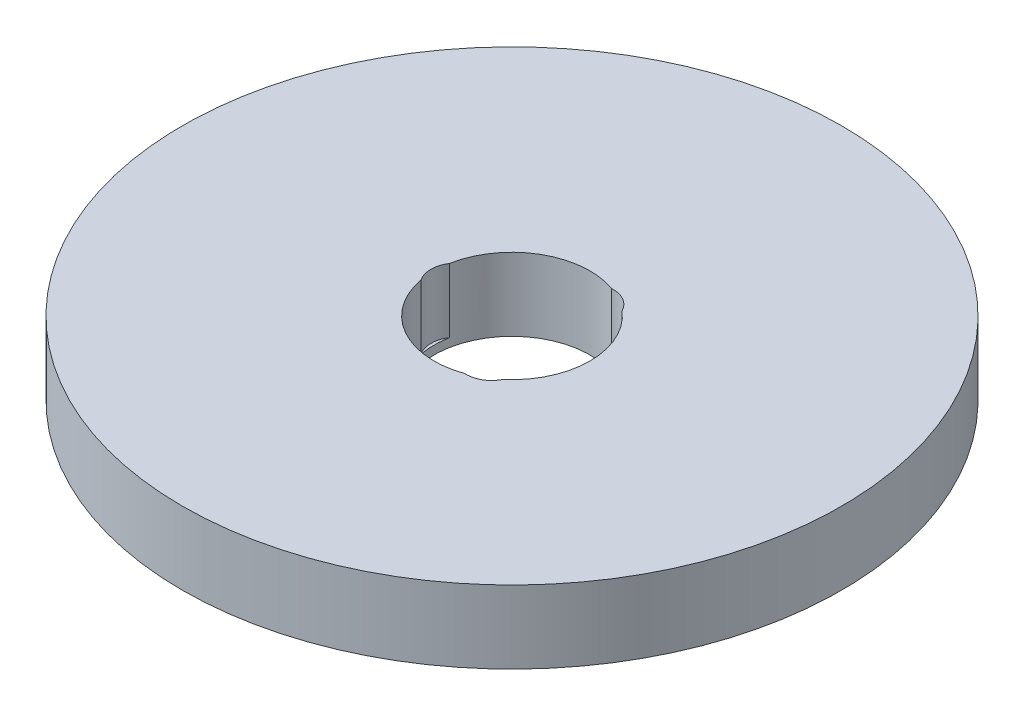
ISO-10303-21;
HEADER;
FILE_DESCRIPTION(('STEP AP214'),'2;1');
FILE_NAME('part.step','',(''),(''),'','','');
FILE_SCHEMA(('AUTOMOTIVE_DESIGN { 1 0 10303 214 1 1 1 1 }'));
ENDSEC;
DATA;
#1=APPLICATION_CONTEXT('core data for automotive mechanical design processes');
#2=APPLICATION_PROTOCOL_DEFINITION('international standard','automotive_design',2000,#1);
#3=PRODUCT_CONTEXT('',#1,'mechanical');
#4=PRODUCT('Part','Part','',(#3));
#5=PRODUCT_RELATED_PRODUCT_CATEGORY('part','',(#4));
#6=PRODUCT_DEFINITION_FORMATION('','',#4);
#7=PRODUCT_DEFINITION_CONTEXT('part definition',#1,'design');
#8=PRODUCT_DEFINITION('design','',#6,#7);
#9=PRODUCT_DEFINITION_SHAPE('','',#8);
#10=(LENGTH_UNIT() NAMED_UNIT(*) SI_UNIT(.MILLI.,.METRE.));
#11=(NAMED_UNIT(*) PLANE_ANGLE_UNIT() SI_UNIT($,.RADIAN.));
#12=(NAMED_UNIT(*) SI_UNIT($,.STERADIAN.) SOLID_ANGLE_UNIT());
#13=UNCERTAINTY_MEASURE_WITH_UNIT(LENGTH_MEASURE(1.E-05),#10,'distance_accuracy_value','');
#14=(GEOMETRIC_REPRESENTATION_CONTEXT(3) GLOBAL_UNCERTAINTY_ASSIGNED_CONTEXT((#13)) GLOBAL_UNIT_ASSIGNED_CONTEXT((#10,
#11,#12)) REPRESENTATION_CONTEXT('',''));
#15=CARTESIAN_POINT('',(0.,0.,0.));
#16=DIRECTION('',(0.,0.,1.));
#17=DIRECTION('',(1.,0.,0.));
#18=AXIS2_PLACEMENT_3D('',#15,#16,#17);
#19=CARTESIAN_POINT('',(0.,21.,0.));
#20=DIRECTION('',(0.,-1.,0.));
#21=DIRECTION('',(0.,0.,-1.));
#22=AXIS2_PLACEMENT_3D('',#19,#20,#21);
#23=CYLINDRICAL_SURFACE('',#22,95.);
#24=CARTESIAN_POINT('',(0.,21.,0.));
#25=DIRECTION('',(0.,1.,0.));
#26=DIRECTION('',(0.,0.,1.));
#27=AXIS2_PLACEMENT_3D('',#24,#25,#26);
#28=CIRCLE('',#27,95.);
#29=CARTESIAN_POINT('',(0.,21.,-95.));
#30=VERTEX_POINT('',#29);
#31=EDGE_CURVE('E130',#30,#30,#28,.T.);
#32=CARTESIAN_POINT('',(0.,0.,0.));
#33=DIRECTION('',(0.,1.,0.));
#34=DIRECTION('',(0.,0.,1.));
#35=AXIS2_PLACEMENT_3D('',#32,#33,#34);
#36=CIRCLE('',#35,95.);
#37=CARTESIAN_POINT('',(0.,0.,-95.));
#38=VERTEX_POINT('',#37);
#39=EDGE_CURVE('E117',#38,#38,#36,.T.);
#40=CARTESIAN_POINT('',(0.,21.,-95.));
#41=CARTESIAN_POINT('',(0.,20.78125,-95.));
#42=CARTESIAN_POINT('',(0.,20.5625,-95.));
#43=CARTESIAN_POINT('',(0.,20.125,-95.));
#44=CARTESIAN_POINT('',(0.,19.90625,-95.));
#45=CARTESIAN_POINT('',(0.,19.46875,-95.));
#46=CARTESIAN_POINT('',(0.,19.25,-95.));
#47=CARTESIAN_POINT('',(0.,18.8125,-95.));
#48=CARTESIAN_POINT('',(0.,18.59375,-95.));
#49=CARTESIAN_POINT('',(0.,18.15625,-95.));
#50=CARTESIAN_POINT('',(0.,17.9375,-95.));
#51=CARTESIAN_POINT('',(0.,17.5,-95.));
#52=CARTESIAN_POINT('',(0.,17.28125,-95.));
#53=CARTESIAN_POINT('',(0.,16.84375,-95.));
#54=CARTESIAN_POINT('',(0.,16.625,-95.));
#55=CARTESIAN_POINT('',(0.,16.1875,-95.));
#56=CARTESIAN_POINT('',(0.,15.96875,-95.));
#57=CARTESIAN_POINT('',(0.,15.53125,-95.));
#58=CARTESIAN_POINT('',(0.,15.3125,-95.));
#59=CARTESIAN_POINT('',(0.,14.875,-95.));
#60=CARTESIAN_POINT('',(0.,14.65625,-95.));
#61=CARTESIAN_POINT('',(0.,14.21875,-95.));
#62=CARTESIAN_POINT('',(0.,14.,-95.));
#63=CARTESIAN_POINT('',(0.,13.5625,-95.));
#64=CARTESIAN_POINT('',(0.,13.34375,-95.));
#65=CARTESIAN_POINT('',(0.,12.90625,-95.));
#66=CARTESIAN_POINT('',(0.,12.6875,-95.));
#67=CARTESIAN_POINT('',(0.,12.25,-95.));
#68=CARTESIAN_POINT('',(0.,12.03125,-95.));
#69=CARTESIAN_POINT('',(0.,11.59375,-95.));
#70=CARTESIAN_POINT('',(0.,11.375,-95.));
#71=CARTESIAN_POINT('',(0.,10.9375,-95.));
#72=CARTESIAN_POINT('',(0.,10.71875,-95.));
#73=CARTESIAN_POINT('',(0.,10.28125,-95.));
#74=CARTESIAN_POINT('',(0.,10.0625,-95.));
#75=CARTESIAN_POINT('',(0.,9.625,-95.));
#76=CARTESIAN_POINT('',(0.,9.40625,-95.));
#77=CARTESIAN_POINT('',(0.,8.96875,-95.));
#78=CARTESIAN_POINT('',(0.,8.75,-95.));
#79=CARTESIAN_POINT('',(0.,8.3125,-95.));
#80=CARTESIAN_POINT('',(0.,8.09375,-95.));
#81=CARTESIAN_POINT('',(0.,7.65625,-95.));
#82=CARTESIAN_POINT('',(0.,7.4375,-95.));
#83=CARTESIAN_POINT('',(0.,7.,-95.));
#84=CARTESIAN_POINT('',(0.,6.78125,-95.));
#85=CARTESIAN_POINT('',(0.,6.34375,-95.));
#86=CARTESIAN_POINT('',(0.,6.125,-95.));
#87=CARTESIAN_POINT('',(0.,5.6875,-95.));
#88=CARTESIAN_POINT('',(0.,5.46875,-95.));
#89=CARTESIAN_POINT('',(0.,5.03125,-95.));
#90=CARTESIAN_POINT('',(0.,4.8125,-95.));
#91=CARTESIAN_POINT('',(0.,4.375,-95.));
#92=CARTESIAN_POINT('',(0.,4.15625,-95.));
#93=CARTESIAN_POINT('',(0.,3.71875,-95.));
#94=CARTESIAN_POINT('',(0.,3.5,-95.));
#95=CARTESIAN_POINT('',(0.,3.0625,-95.));
#96=CARTESIAN_POINT('',(0.,2.84375,-95.));
#97=CARTESIAN_POINT('',(0.,2.40625,-95.));
#98=CARTESIAN_POINT('',(0.,2.1875,-95.));
#99=CARTESIAN_POINT('',(0.,1.75,-95.));
#100=CARTESIAN_POINT('',(0.,1.53125,-95.));
#101=CARTESIAN_POINT('',(0.,1.09375,-95.));
#102=CARTESIAN_POINT('',(0.,0.875000000000001,-95.));
#103=CARTESIAN_POINT('',(0.,0.4375,-95.));
#104=CARTESIAN_POINT('',(0.,0.21875,-95.));
#105=CARTESIAN_POINT('',(0.,0.,-95.));
#106=B_SPLINE_CURVE_WITH_KNOTS('',3,(#40,#41,#42,#43,#44,#45,#46,#47,#48,#49,#50,#51,#52,#53,
#54,#55,#56,#57,#58,#59,#60,#61,#62,#63,#64,#65,#66,#67,#68,#69,#70,#71,#72,#73,#74,#75,#76,#77,
#78,#79,#80,#81,#82,#83,#84,#85,#86,#87,#88,#89,#90,#91,#92,#93,#94,#95,#96,#97,#98,#99,#100,
#101,#102,#103,#104,#105),.UNSPECIFIED.,.F.,.F.,(4,2,2,2,2,2,2,2,2,2,2,2,2,2,2,2,2,2,2,2,2,2,2,
2,2,2,2,2,2,2,2,2,4),(0.,0.656249999999997,1.3125,1.96875,2.625,3.28125,3.9375,4.59375,5.25,
5.90625,6.5625,7.21875,7.875,8.53125,9.1875,9.84375,10.5,11.15625,11.8125,12.46875,13.125,
13.78125,14.4375,15.09375,15.75,16.40625,17.0625,17.71875,18.375,19.03125,19.6875,20.34375,21.),.UNSPECIFIED.);
#107=EDGE_CURVE('BSEAM39',#30,#38,#106,.T.);
#108=ORIENTED_EDGE('',*,*,#31,.F.);
#109=ORIENTED_EDGE('',*,*,#39,.T.);
#110=ORIENTED_EDGE('',*,*,#107,.T.);
#111=ORIENTED_EDGE('',*,*,#107,.F.);
#112=EDGE_LOOP('',(#108,#110,#109,#111));
#113=FACE_BOUND('',#112,.T.);
#114=ADVANCED_FACE('F39',(#113),#23,.T.);
#115=CARTESIAN_POINT('',(0.,21.,0.));
#116=DIRECTION('',(0.,1.,0.));
#117=DIRECTION('',(0.,0.,1.));
#118=AXIS2_PLACEMENT_3D('',#115,#116,#117);
#119=PLANE('',#118);
#120=CARTESIAN_POINT('',(7.97936512743033,21.,13.8206658128525));
#121=DIRECTION('',(0.,1.,0.));
#122=DIRECTION('',(0.866025403784436,0.,-0.500000000000004));
#123=AXIS2_PLACEMENT_3D('',#120,#121,#122);
#124=CIRCLE('',#123,7.38393204363788);
#125=CARTESIAN_POINT('',(7.55810302005219,21.,21.1925713102086));
#126=VERTEX_POINT('',#125);
#127=CARTESIAN_POINT('',(14.574253616128,21.,17.1417948748893));
#128=VERTEX_POINT('',#127);
#129=EDGE_CURVE('E148',#126,#128,#124,.T.);
#130=ORIENTED_EDGE('',*,*,#129,.F.);
#131=CARTESIAN_POINT('',(0.,21.,0.));
#132=DIRECTION('',(0.,1.,0.));
#133=DIRECTION('',(0.,0.,1.));
#134=AXIS2_PLACEMENT_3D('',#131,#132,#133);
#135=CIRCLE('',#134,22.5);
#136=CARTESIAN_POINT('',(-22.13235663618,21.,4.05077643531933));
#137=VERTEX_POINT('',#136);
#138=EDGE_CURVE('E113',#137,#126,#135,.T.);
#139=ORIENTED_EDGE('',*,*,#138,.F.);
#140=CARTESIAN_POINT('',(-15.9587302548605,21.,0.));
#141=DIRECTION('',(0.,1.,0.));
#142=DIRECTION('',(0.,0.,1.));
#143=AXIS2_PLACEMENT_3D('',#140,#141,#142);
#144=CIRCLE('',#143,7.38393204363788);
#145=CARTESIAN_POINT('',(-22.13235663618,21.,-4.05077643531933));
#146=VERTEX_POINT('',#145);
#147=EDGE_CURVE('E125',#146,#137,#144,.T.);
#148=ORIENTED_EDGE('',*,*,#147,.F.);
#149=CARTESIAN_POINT('',(7.55810302005191,21.,-21.1925713102087));
#150=VERTEX_POINT('',#149);
#151=EDGE_CURVE('E107',#150,#146,#135,.T.);
#152=ORIENTED_EDGE('',*,*,#151,.F.);
#153=CARTESIAN_POINT('',(7.97936512743014,21.,-13.8206658128526));
#154=DIRECTION('',(0.,1.,0.));
#155=DIRECTION('',(-0.866025403784443,0.,-0.499999999999992));
#156=AXIS2_PLACEMENT_3D('',#153,#154,#155);
#157=CIRCLE('',#156,7.38393204363788);
#158=CARTESIAN_POINT('',(14.5742536161278,21.,-17.1417948748895));
#159=VERTEX_POINT('',#158);
#160=EDGE_CURVE('E95',#159,#150,#157,.T.);
#161=ORIENTED_EDGE('',*,*,#160,.F.);
#162=EDGE_CURVE('E106',#128,#159,#135,.T.);
#163=ORIENTED_EDGE('',*,*,#162,.F.);
#164=EDGE_LOOP('',(#130,#139,#148,#152,#161,#163));
#165=FACE_BOUND('',#164,.T.);
#166=ORIENTED_EDGE('',*,*,#31,.T.);
#167=EDGE_LOOP('',(#166));
#168=FACE_BOUND('',#167,.T.);
#169=ADVANCED_FACE('F102',(#165,#168),#119,.T.);
#170=CARTESIAN_POINT('',(0.,0.,0.));
#171=DIRECTION('',(0.,1.,0.));
#172=DIRECTION('',(0.,0.,1.));
#173=AXIS2_PLACEMENT_3D('',#170,#171,#172);
#174=PLANE('',#173);
#175=CARTESIAN_POINT('',(0.,0.,0.));
#176=DIRECTION('',(0.,1.,0.));
#177=DIRECTION('',(0.,0.,1.));
#178=AXIS2_PLACEMENT_3D('',#175,#176,#177);
#179=CIRCLE('',#178,22.5);
#180=CARTESIAN_POINT('',(0.,0.,22.5));
#181=VERTEX_POINT('',#180);
#182=EDGE_CURVE('E118',#181,#181,#179,.T.);
#183=ORIENTED_EDGE('',*,*,#182,.T.);
#184=EDGE_LOOP('',(#183));
#185=FACE_BOUND('',#184,.T.);
#186=ORIENTED_EDGE('',*,*,#39,.F.);
#187=EDGE_LOOP('',(#186));
#188=FACE_BOUND('',#187,.T.);
#189=ADVANCED_FACE('F161',(#185,#188),#174,.F.);
#190=CARTESIAN_POINT('',(0.,21.,0.));
#191=DIRECTION('',(0.,-1.,0.));
#192=DIRECTION('',(0.,0.,-1.));
#193=AXIS2_PLACEMENT_3D('',#190,#191,#192);
#194=CYLINDRICAL_SURFACE('',#193,22.5);
#195=DIRECTION('',(0.,1.,0.));
#196=VECTOR('',#195,1.);
#197=CARTESIAN_POINT('',(7.55810302005218,11.7390662718309,21.1925713102086));
#198=LINE('',#197,#196);
#199=CARTESIAN_POINT('',(7.55810302005219,2.47813254366185,21.1925713102086));
#200=VERTEX_POINT('',#199);
#201=EDGE_CURVE('E11',#200,#126,#198,.T.);
#202=ORIENTED_EDGE('',*,*,#201,.F.);
#203=CARTESIAN_POINT('',(0.,2.47813254366185,0.));
#204=DIRECTION('',(0.,1.,0.));
#205=DIRECTION('',(0.,0.,1.));
#206=AXIS2_PLACEMENT_3D('',#203,#204,#205);
#207=CIRCLE('',#206,22.5);
#208=CARTESIAN_POINT('',(14.574253616128,2.47813254366185,17.1417948748893));
#209=VERTEX_POINT('',#208);
#210=EDGE_CURVE('E100',#200,#209,#207,.T.);
#211=ORIENTED_EDGE('',*,*,#210,.T.);
#212=DIRECTION('',(0.,1.,0.));
#213=VECTOR('',#212,1.);
#214=CARTESIAN_POINT('',(14.574253616128,11.7390662718309,17.1417948748893));
#215=LINE('',#214,#213);
#216=EDGE_CURVE('E46',#128,#209,#215,.F.);
#217=ORIENTED_EDGE('',*,*,#216,.F.);
#218=ORIENTED_EDGE('',*,*,#162,.T.);
#219=DIRECTION('',(0.,1.,0.));
#220=VECTOR('',#219,1.);
#221=CARTESIAN_POINT('',(14.5742536161278,11.7390662718309,-17.1417948748895));
#222=LINE('',#221,#220);
#223=CARTESIAN_POINT('',(14.5742536161278,2.47813254366185,-17.1417948748895));
#224=VERTEX_POINT('',#223);
#225=EDGE_CURVE('E90',#224,#159,#222,.T.);
#226=ORIENTED_EDGE('',*,*,#225,.F.);
#227=CARTESIAN_POINT('',(0.,2.47813254366185,0.));
#228=DIRECTION('',(0.,1.,0.));
#229=DIRECTION('',(0.,0.,1.));
#230=AXIS2_PLACEMENT_3D('',#227,#228,#229);
#231=CIRCLE('',#230,22.5);
#232=CARTESIAN_POINT('',(7.55810302005191,2.47813254366185,-21.1925713102087));
#233=VERTEX_POINT('',#232);
#234=EDGE_CURVE('E143',#224,#233,#231,.T.);
#235=ORIENTED_EDGE('',*,*,#234,.T.);
#236=DIRECTION('',(0.,1.,0.));
#237=VECTOR('',#236,1.);
#238=CARTESIAN_POINT('',(7.55810302005191,11.7390662718309,-21.1925713102087));
#239=LINE('',#238,#237);
#240=EDGE_CURVE('E98',#150,#233,#239,.F.);
#241=ORIENTED_EDGE('',*,*,#240,.F.);
#242=ORIENTED_EDGE('',*,*,#151,.T.);
#243=DIRECTION('',(0.,1.,0.));
#244=VECTOR('',#243,1.);
#245=CARTESIAN_POINT('',(-22.13235663618,11.7390662718309,-4.05077643531932));
#246=LINE('',#245,#244);
#247=CARTESIAN_POINT('',(-22.13235663618,2.47813254366185,-4.05077643531933));
#248=VERTEX_POINT('',#247);
#249=EDGE_CURVE('E137',#248,#146,#246,.T.);
#250=ORIENTED_EDGE('',*,*,#249,.F.);
#251=CARTESIAN_POINT('',(0.,2.47813254366185,0.));
#252=DIRECTION('',(0.,1.,0.));
#253=DIRECTION('',(0.,0.,1.));
#254=AXIS2_PLACEMENT_3D('',#251,#252,#253);
#255=CIRCLE('',#254,22.5);
#256=CARTESIAN_POINT('',(-22.13235663618,2.47813254366185,4.05077643531933));
#257=VERTEX_POINT('',#256);
#258=EDGE_CURVE('E128',#248,#257,#255,.T.);
#259=ORIENTED_EDGE('',*,*,#258,.T.);
#260=DIRECTION('',(0.,1.,0.));
#261=VECTOR('',#260,1.);
#262=CARTESIAN_POINT('',(-22.13235663618,11.7390662718309,4.05077643531932));
#263=LINE('',#262,#261);
#264=EDGE_CURVE('E134',#137,#257,#263,.F.);
#265=ORIENTED_EDGE('',*,*,#264,.F.);
#266=ORIENTED_EDGE('',*,*,#138,.T.);
#267=EDGE_LOOP('',(#202,#211,#217,#218,#226,#235,#241,#242,#250,#259,#265,#266));
#268=FACE_BOUND('',#267,.T.);
#269=ORIENTED_EDGE('',*,*,#182,.F.);
#270=EDGE_LOOP('',(#269));
#271=FACE_BOUND('',#270,.T.);
#272=ADVANCED_FACE('F115',(#268,#271),#194,.F.);
#273=CARTESIAN_POINT('',(-15.9587302548605,2.47813254366185,0.));
#274=DIRECTION('',(0.,1.,0.));
#275=DIRECTION('',(0.,0.,1.));
#276=AXIS2_PLACEMENT_3D('',#273,#274,#275);
#277=CYLINDRICAL_SURFACE('',#276,7.38393204363788);
#278=ORIENTED_EDGE('',*,*,#249,.T.);
#279=ORIENTED_EDGE('',*,*,#147,.T.);
#280=ORIENTED_EDGE('',*,*,#264,.T.);
#281=CARTESIAN_POINT('',(-15.9587302548605,2.47813254366185,0.));
#282=DIRECTION('',(0.,1.,0.));
#283=DIRECTION('',(0.,0.,1.));
#284=AXIS2_PLACEMENT_3D('',#281,#282,#283);
#285=CIRCLE('',#284,7.38393204363788);
#286=EDGE_CURVE('E127',#248,#257,#285,.T.);
#287=ORIENTED_EDGE('',*,*,#286,.F.);
#288=EDGE_LOOP('',(#278,#279,#280,#287));
#289=FACE_BOUND('',#288,.T.);
#290=ADVANCED_FACE('F175',(#289),#277,.F.);
#291=CARTESIAN_POINT('',(-15.9587302548605,2.47813254366185,0.));
#292=DIRECTION('',(0.,1.,0.));
#293=DIRECTION('',(0.,0.,1.));
#294=AXIS2_PLACEMENT_3D('',#291,#292,#293);
#295=PLANE('',#294);
#296=ORIENTED_EDGE('',*,*,#286,.T.);
#297=ORIENTED_EDGE('',*,*,#258,.F.);
#298=EDGE_LOOP('',(#296,#297));
#299=FACE_BOUND('',#298,.T.);
#300=ADVANCED_FACE('F176',(#299),#295,.T.);
#301=CARTESIAN_POINT('',(7.97936512743014,2.47813254366185,-13.8206658128526));
#302=DIRECTION('',(0.,1.,0.));
#303=DIRECTION('',(0.,0.,1.));
#304=AXIS2_PLACEMENT_3D('',#301,#302,#303);
#305=CYLINDRICAL_SURFACE('',#304,7.38393204363788);
#306=ORIENTED_EDGE('',*,*,#225,.T.);
#307=ORIENTED_EDGE('',*,*,#160,.T.);
#308=ORIENTED_EDGE('',*,*,#240,.T.);
#309=CARTESIAN_POINT('',(7.97936512743014,2.47813254366185,-13.8206658128526));
#310=DIRECTION('',(0.,1.,0.));
#311=DIRECTION('',(-0.866025403784443,0.,-0.499999999999992));
#312=AXIS2_PLACEMENT_3D('',#309,#310,#311);
#313=CIRCLE('',#312,7.38393204363788);
#314=EDGE_CURVE('E56',#224,#233,#313,.T.);
#315=ORIENTED_EDGE('',*,*,#314,.F.);
#316=EDGE_LOOP('',(#306,#307,#308,#315));
#317=FACE_BOUND('',#316,.T.);
#318=ADVANCED_FACE('F93',(#317),#305,.F.);
#319=CARTESIAN_POINT('',(7.97936512743014,2.47813254366185,-13.8206658128526));
#320=DIRECTION('',(0.,1.,0.));
#321=DIRECTION('',(-0.866025403784443,0.,-0.499999999999992));
#322=AXIS2_PLACEMENT_3D('',#319,#320,#321);
#323=PLANE('',#322);
#324=ORIENTED_EDGE('',*,*,#314,.T.);
#325=ORIENTED_EDGE('',*,*,#234,.F.);
#326=EDGE_LOOP('',(#324,#325));
#327=FACE_BOUND('',#326,.T.);
#328=ADVANCED_FACE('F153',(#327),#323,.T.);
#329=CARTESIAN_POINT('',(7.97936512743033,2.47813254366185,13.8206658128525));
#330=DIRECTION('',(0.,1.,0.));
#331=DIRECTION('',(0.,0.,1.));
#332=AXIS2_PLACEMENT_3D('',#329,#330,#331);
#333=CYLINDRICAL_SURFACE('',#332,7.38393204363788);
#334=ORIENTED_EDGE('',*,*,#201,.T.);
#335=ORIENTED_EDGE('',*,*,#129,.T.);
#336=ORIENTED_EDGE('',*,*,#216,.T.);
#337=CARTESIAN_POINT('',(7.97936512743033,2.47813254366185,13.8206658128525));
#338=DIRECTION('',(0.,1.,0.));
#339=DIRECTION('',(0.866025403784436,0.,-0.500000000000004));
#340=AXIS2_PLACEMENT_3D('',#337,#338,#339);
#341=CIRCLE('',#340,7.38393204363788);
#342=EDGE_CURVE('E55',#200,#209,#341,.T.);
#343=ORIENTED_EDGE('',*,*,#342,.F.);
#344=EDGE_LOOP('',(#334,#335,#336,#343));
#345=FACE_BOUND('',#344,.T.);
#346=ADVANCED_FACE('F144',(#345),#333,.F.);
#347=CARTESIAN_POINT('',(7.97936512743033,2.47813254366185,13.8206658128525));
#348=DIRECTION('',(0.,1.,0.));
#349=DIRECTION('',(0.866025403784436,0.,-0.500000000000004));
#350=AXIS2_PLACEMENT_3D('',#347,#348,#349);
#351=PLANE('',#350);
#352=ORIENTED_EDGE('',*,*,#342,.T.);
#353=ORIENTED_EDGE('',*,*,#210,.F.);
#354=EDGE_LOOP('',(#352,#353));
#355=FACE_BOUND('',#354,.T.);
#356=ADVANCED_FACE('F150',(#355),#351,.T.);
#357=CLOSED_SHELL('',(#114,#169,#189,#272,#290,#300,#318,#328,#346,#356));
#358=MANIFOLD_SOLID_BREP('B2',#357);
#359=ADVANCED_BREP_SHAPE_REPRESENTATION('',(#18,#358),#14);
#360=SHAPE_DEFINITION_REPRESENTATION(#9,#359);
ENDSEC;
END-ISO-10303-21;
